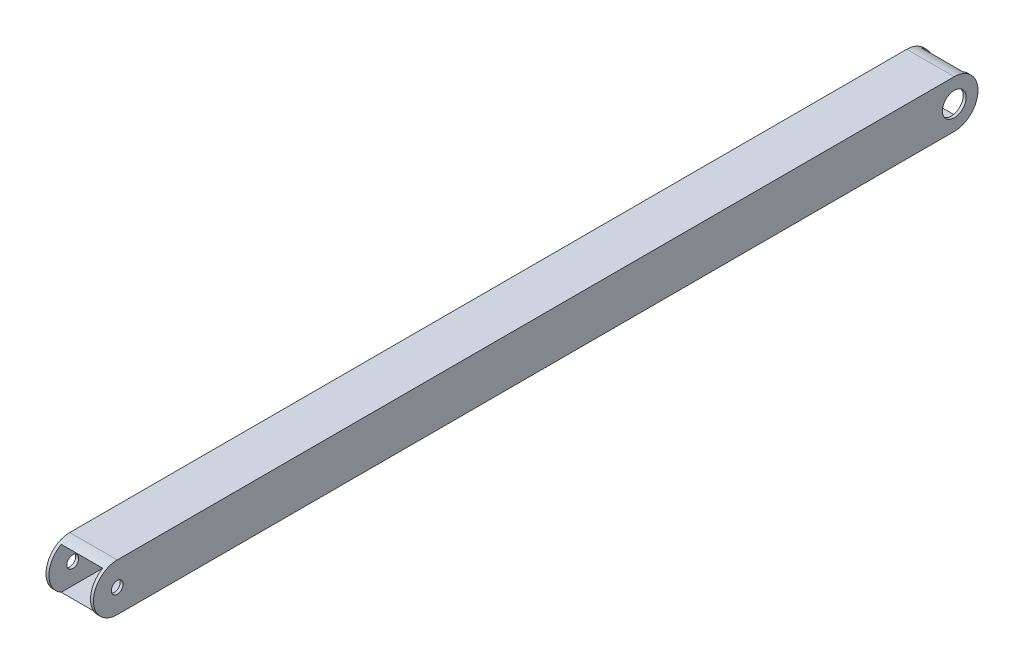
ISO-10303-21;
HEADER;
FILE_DESCRIPTION(('STEP AP214'),'2;1');
FILE_NAME('part.step','',(''),(''),'','','');
FILE_SCHEMA(('AUTOMOTIVE_DESIGN { 1 0 10303 214 1 1 1 1 }'));
ENDSEC;
DATA;
#1=APPLICATION_CONTEXT('core data for automotive mechanical design processes');
#2=APPLICATION_PROTOCOL_DEFINITION('international standard','automotive_design',2000,#1);
#3=PRODUCT_CONTEXT('',#1,'mechanical');
#4=PRODUCT('Part','Part','',(#3));
#5=PRODUCT_RELATED_PRODUCT_CATEGORY('part','',(#4));
#6=PRODUCT_DEFINITION_FORMATION('','',#4);
#7=PRODUCT_DEFINITION_CONTEXT('part definition',#1,'design');
#8=PRODUCT_DEFINITION('design','',#6,#7);
#9=PRODUCT_DEFINITION_SHAPE('','',#8);
#10=(LENGTH_UNIT() NAMED_UNIT(*) SI_UNIT(.MILLI.,.METRE.));
#11=(NAMED_UNIT(*) PLANE_ANGLE_UNIT() SI_UNIT($,.RADIAN.));
#12=(NAMED_UNIT(*) SI_UNIT($,.STERADIAN.) SOLID_ANGLE_UNIT());
#13=UNCERTAINTY_MEASURE_WITH_UNIT(LENGTH_MEASURE(1.E-05),#10,'distance_accuracy_value','');
#14=(GEOMETRIC_REPRESENTATION_CONTEXT(3) GLOBAL_UNCERTAINTY_ASSIGNED_CONTEXT((#13)) GLOBAL_UNIT_ASSIGNED_CONTEXT((#10,
#11,#12)) REPRESENTATION_CONTEXT('',''));
#15=CARTESIAN_POINT('',(0.,0.,0.));
#16=DIRECTION('',(0.,0.,1.));
#17=DIRECTION('',(1.,0.,0.));
#18=AXIS2_PLACEMENT_3D('',#15,#16,#17);
#19=CARTESIAN_POINT('',(12.7,12.7,473.2274));
#20=DIRECTION('',(-1.,0.,0.));
#21=DIRECTION('',(0.,-1.,0.));
#22=AXIS2_PLACEMENT_3D('',#19,#20,#21);
#23=PLANE('',#22);
#24=CARTESIAN_POINT('',(12.7,0.,460.5274));
#25=DIRECTION('',(1.,0.,0.));
#26=DIRECTION('',(0.,1.,0.));
#27=AXIS2_PLACEMENT_3D('',#24,#25,#26);
#28=CIRCLE('',#27,3.17499999999997);
#29=CARTESIAN_POINT('',(12.7,3.17499999999997,460.5274));
#30=VERTEX_POINT('',#29);
#31=EDGE_CURVE('E233',#30,#30,#28,.T.);
#32=ORIENTED_EDGE('',*,*,#31,.F.);
#33=EDGE_LOOP('',(#32));
#34=FACE_BOUND('',#33,.T.);
#35=CARTESIAN_POINT('',(12.7,0.,12.7));
#36=DIRECTION('',(1.,0.,0.));
#37=DIRECTION('',(0.,1.,0.));
#38=AXIS2_PLACEMENT_3D('',#35,#36,#37);
#39=CIRCLE('',#38,6.35);
#40=CARTESIAN_POINT('',(12.7,6.35,12.7));
#41=VERTEX_POINT('',#40);
#42=EDGE_CURVE('E187',#41,#41,#39,.T.);
#43=ORIENTED_EDGE('',*,*,#42,.F.);
#44=EDGE_LOOP('',(#43));
#45=FACE_BOUND('',#44,.T.);
#46=DIRECTION('',(0.,0.,-1.));
#47=VECTOR('',#46,1.);
#48=CARTESIAN_POINT('',(12.7,-12.7,473.2274));
#49=LINE('',#48,#47);
#50=CARTESIAN_POINT('',(12.7,-12.7,460.5274));
#51=VERTEX_POINT('',#50);
#52=CARTESIAN_POINT('',(12.7,-12.7,12.7));
#53=VERTEX_POINT('',#52);
#54=EDGE_CURVE('E157',#51,#53,#49,.T.);
#55=ORIENTED_EDGE('',*,*,#54,.T.);
#56=CARTESIAN_POINT('',(12.7,0.,12.7));
#57=DIRECTION('',(1.,0.,0.));
#58=DIRECTION('',(0.,1.,0.));
#59=AXIS2_PLACEMENT_3D('',#56,#57,#58);
#60=CIRCLE('',#59,12.7);
#61=CARTESIAN_POINT('',(12.7,12.7,12.7));
#62=VERTEX_POINT('',#61);
#63=EDGE_CURVE('E143',#62,#53,#60,.F.);
#64=ORIENTED_EDGE('',*,*,#63,.F.);
#65=DIRECTION('',(0.,0.,-1.));
#66=VECTOR('',#65,1.);
#67=CARTESIAN_POINT('',(12.7,12.7,473.2274));
#68=LINE('',#67,#66);
#69=CARTESIAN_POINT('',(12.7,12.7,460.5274));
#70=VERTEX_POINT('',#69);
#71=EDGE_CURVE('E159',#70,#62,#68,.T.);
#72=ORIENTED_EDGE('',*,*,#71,.F.);
#73=CARTESIAN_POINT('',(12.7,0.,460.5274));
#74=DIRECTION('',(1.,0.,0.));
#75=DIRECTION('',(0.,1.,0.));
#76=AXIS2_PLACEMENT_3D('',#73,#74,#75);
#77=CIRCLE('',#76,12.7);
#78=EDGE_CURVE('E191',#70,#51,#77,.T.);
#79=ORIENTED_EDGE('',*,*,#78,.T.);
#80=EDGE_LOOP('',(#55,#64,#72,#79));
#81=FACE_BOUND('',#80,.T.);
#82=ADVANCED_FACE('F72',(#34,#45,#81),#23,.F.);
#83=CARTESIAN_POINT('',(-12.7,12.7,473.2274));
#84=DIRECTION('',(1.,0.,0.));
#85=DIRECTION('',(0.,1.,0.));
#86=AXIS2_PLACEMENT_3D('',#83,#84,#85);
#87=PLANE('',#86);
#88=CARTESIAN_POINT('',(-12.7,0.,460.5274));
#89=DIRECTION('',(1.,0.,0.));
#90=DIRECTION('',(0.,1.,0.));
#91=AXIS2_PLACEMENT_3D('',#88,#89,#90);
#92=CIRCLE('',#91,3.17499999999997);
#93=CARTESIAN_POINT('',(-12.7,3.17499999999996,460.5274));
#94=VERTEX_POINT('',#93);
#95=EDGE_CURVE('E174',#94,#94,#92,.T.);
#96=ORIENTED_EDGE('',*,*,#95,.T.);
#97=EDGE_LOOP('',(#96));
#98=FACE_BOUND('',#97,.T.);
#99=CARTESIAN_POINT('',(-12.7,0.,12.7));
#100=DIRECTION('',(1.,0.,0.));
#101=DIRECTION('',(0.,1.,0.));
#102=AXIS2_PLACEMENT_3D('',#99,#100,#101);
#103=CIRCLE('',#102,6.35);
#104=CARTESIAN_POINT('',(-12.7,6.35,12.7));
#105=VERTEX_POINT('',#104);
#106=EDGE_CURVE('E227',#105,#105,#103,.T.);
#107=ORIENTED_EDGE('',*,*,#106,.T.);
#108=EDGE_LOOP('',(#107));
#109=FACE_BOUND('',#108,.T.);
#110=CARTESIAN_POINT('',(-12.7,0.,12.7));
#111=DIRECTION('',(1.,0.,0.));
#112=DIRECTION('',(0.,1.,0.));
#113=AXIS2_PLACEMENT_3D('',#110,#111,#112);
#114=CIRCLE('',#113,12.7);
#115=CARTESIAN_POINT('',(-12.7,12.7,12.7));
#116=VERTEX_POINT('',#115);
#117=CARTESIAN_POINT('',(-12.7,-12.7,12.7));
#118=VERTEX_POINT('',#117);
#119=EDGE_CURVE('E86',#116,#118,#114,.F.);
#120=ORIENTED_EDGE('',*,*,#119,.T.);
#121=DIRECTION('',(0.,0.,-1.));
#122=VECTOR('',#121,1.);
#123=CARTESIAN_POINT('',(-12.7,-12.7,473.2274));
#124=LINE('',#123,#122);
#125=CARTESIAN_POINT('',(-12.7,-12.7,460.5274));
#126=VERTEX_POINT('',#125);
#127=EDGE_CURVE('E139',#126,#118,#124,.T.);
#128=ORIENTED_EDGE('',*,*,#127,.F.);
#129=CARTESIAN_POINT('',(-12.7,0.,460.5274));
#130=DIRECTION('',(1.,0.,0.));
#131=DIRECTION('',(0.,1.,0.));
#132=AXIS2_PLACEMENT_3D('',#129,#130,#131);
#133=CIRCLE('',#132,12.7);
#134=CARTESIAN_POINT('',(-12.7,12.7,460.5274));
#135=VERTEX_POINT('',#134);
#136=EDGE_CURVE('E192',#135,#126,#133,.T.);
#137=ORIENTED_EDGE('',*,*,#136,.F.);
#138=DIRECTION('',(0.,0.,-1.));
#139=VECTOR('',#138,1.);
#140=CARTESIAN_POINT('',(-12.7,12.7,473.2274));
#141=LINE('',#140,#139);
#142=EDGE_CURVE('E141',#135,#116,#141,.T.);
#143=ORIENTED_EDGE('',*,*,#142,.T.);
#144=EDGE_LOOP('',(#120,#128,#137,#143));
#145=FACE_BOUND('',#144,.T.);
#146=ADVANCED_FACE('F136',(#98,#109,#145),#87,.F.);
#147=CARTESIAN_POINT('',(-11.1125,11.1125,473.2274));
#148=DIRECTION('',(1.,0.,0.));
#149=DIRECTION('',(0.,1.,0.));
#150=AXIS2_PLACEMENT_3D('',#147,#148,#149);
#151=PLANE('',#150);
#152=CARTESIAN_POINT('',(-11.1125,0.,460.5274));
#153=DIRECTION('',(1.,0.,0.));
#154=DIRECTION('',(0.,1.,0.));
#155=AXIS2_PLACEMENT_3D('',#152,#153,#154);
#156=CIRCLE('',#155,3.17499999999997);
#157=CARTESIAN_POINT('',(-11.1125,3.17499999999997,460.5274));
#158=VERTEX_POINT('',#157);
#159=EDGE_CURVE('E177',#158,#158,#156,.T.);
#160=ORIENTED_EDGE('',*,*,#159,.F.);
#161=EDGE_LOOP('',(#160));
#162=FACE_BOUND('',#161,.T.);
#163=CARTESIAN_POINT('',(-11.1125,0.,12.7));
#164=DIRECTION('',(1.,0.,0.));
#165=DIRECTION('',(0.,1.,0.));
#166=AXIS2_PLACEMENT_3D('',#163,#164,#165);
#167=CIRCLE('',#166,6.35);
#168=CARTESIAN_POINT('',(-11.1125,6.35,12.7));
#169=VERTEX_POINT('',#168);
#170=EDGE_CURVE('E173',#169,#169,#167,.T.);
#171=ORIENTED_EDGE('',*,*,#170,.F.);
#172=EDGE_LOOP('',(#171));
#173=FACE_BOUND('',#172,.T.);
#174=DIRECTION('',(0.,0.,-1.));
#175=VECTOR('',#174,1.);
#176=CARTESIAN_POINT('',(-11.1125,-11.1125,473.2274));
#177=LINE('',#176,#175);
#178=CARTESIAN_POINT('',(-11.1125,-11.1125,466.675761062104));
#179=VERTEX_POINT('',#178);
#180=CARTESIAN_POINT('',(-11.1125,-11.1125,6.55163893789571));
#181=VERTEX_POINT('',#180);
#182=EDGE_CURVE('E161',#179,#181,#177,.T.);
#183=ORIENTED_EDGE('',*,*,#182,.T.);
#184=CARTESIAN_POINT('',(-11.1125,0.,12.7));
#185=DIRECTION('',(1.,0.,0.));
#186=DIRECTION('',(0.,1.,0.));
#187=AXIS2_PLACEMENT_3D('',#184,#185,#186);
#188=CIRCLE('',#187,12.7);
#189=CARTESIAN_POINT('',(-11.1125,11.1125,6.55163893789574));
#190=VERTEX_POINT('',#189);
#191=EDGE_CURVE('E216',#190,#181,#188,.F.);
#192=ORIENTED_EDGE('',*,*,#191,.F.);
#193=DIRECTION('',(0.,0.,-1.));
#194=VECTOR('',#193,1.);
#195=CARTESIAN_POINT('',(-11.1125,11.1125,473.2274));
#196=LINE('',#195,#194);
#197=CARTESIAN_POINT('',(-11.1125,11.1125,466.675761062104));
#198=VERTEX_POINT('',#197);
#199=EDGE_CURVE('E202',#198,#190,#196,.T.);
#200=ORIENTED_EDGE('',*,*,#199,.F.);
#201=CARTESIAN_POINT('',(-11.1125,0.,460.5274));
#202=DIRECTION('',(1.,0.,0.));
#203=DIRECTION('',(0.,1.,0.));
#204=AXIS2_PLACEMENT_3D('',#201,#202,#203);
#205=CIRCLE('',#204,12.7);
#206=EDGE_CURVE('E94',#198,#179,#205,.T.);
#207=ORIENTED_EDGE('',*,*,#206,.T.);
#208=EDGE_LOOP('',(#183,#192,#200,#207));
#209=FACE_BOUND('',#208,.T.);
#210=ADVANCED_FACE('F214',(#162,#173,#209),#151,.T.);
#211=CARTESIAN_POINT('',(11.1125,11.1125,473.2274));
#212=DIRECTION('',(-1.,0.,0.));
#213=DIRECTION('',(0.,-1.,0.));
#214=AXIS2_PLACEMENT_3D('',#211,#212,#213);
#215=PLANE('',#214);
#216=CARTESIAN_POINT('',(11.1125,0.,460.5274));
#217=DIRECTION('',(-1.,0.,0.));
#218=DIRECTION('',(0.,-1.,0.));
#219=AXIS2_PLACEMENT_3D('',#216,#217,#218);
#220=CIRCLE('',#219,3.17499999999997);
#221=CARTESIAN_POINT('',(11.1125,-3.17499999999997,460.5274));
#222=VERTEX_POINT('',#221);
#223=EDGE_CURVE('E175',#222,#222,#220,.T.);
#224=ORIENTED_EDGE('',*,*,#223,.F.);
#225=EDGE_LOOP('',(#224));
#226=FACE_BOUND('',#225,.T.);
#227=CARTESIAN_POINT('',(11.1125,0.,12.7));
#228=DIRECTION('',(-1.,0.,0.));
#229=DIRECTION('',(0.,-1.,0.));
#230=AXIS2_PLACEMENT_3D('',#227,#228,#229);
#231=CIRCLE('',#230,6.35);
#232=CARTESIAN_POINT('',(11.1125,-6.35,12.7));
#233=VERTEX_POINT('',#232);
#234=EDGE_CURVE('E171',#233,#233,#231,.T.);
#235=ORIENTED_EDGE('',*,*,#234,.F.);
#236=EDGE_LOOP('',(#235));
#237=FACE_BOUND('',#236,.T.);
#238=CARTESIAN_POINT('',(11.1125,0.,12.7));
#239=DIRECTION('',(-1.,0.,0.));
#240=DIRECTION('',(0.,-1.,0.));
#241=AXIS2_PLACEMENT_3D('',#238,#239,#240);
#242=CIRCLE('',#241,12.7);
#243=CARTESIAN_POINT('',(11.1125,-11.1125,6.55163893789571));
#244=VERTEX_POINT('',#243);
#245=CARTESIAN_POINT('',(11.1125,11.1125,6.55163893789574));
#246=VERTEX_POINT('',#245);
#247=EDGE_CURVE('E222',#244,#246,#242,.F.);
#248=ORIENTED_EDGE('',*,*,#247,.F.);
#249=DIRECTION('',(0.,0.,-1.));
#250=VECTOR('',#249,1.);
#251=CARTESIAN_POINT('',(11.1125,-11.1125,473.2274));
#252=LINE('',#251,#250);
#253=CARTESIAN_POINT('',(11.1125,-11.1125,466.675761062104));
#254=VERTEX_POINT('',#253);
#255=EDGE_CURVE('E208',#254,#244,#252,.T.);
#256=ORIENTED_EDGE('',*,*,#255,.F.);
#257=CARTESIAN_POINT('',(11.1125,0.,460.5274));
#258=DIRECTION('',(-1.,0.,0.));
#259=DIRECTION('',(0.,-1.,0.));
#260=AXIS2_PLACEMENT_3D('',#257,#258,#259);
#261=CIRCLE('',#260,12.7);
#262=CARTESIAN_POINT('',(11.1125,11.1125,466.675761062104));
#263=VERTEX_POINT('',#262);
#264=EDGE_CURVE('E198',#254,#263,#261,.T.);
#265=ORIENTED_EDGE('',*,*,#264,.T.);
#266=DIRECTION('',(0.,0.,-1.));
#267=VECTOR('',#266,1.);
#268=CARTESIAN_POINT('',(11.1125,11.1125,473.2274));
#269=LINE('',#268,#267);
#270=EDGE_CURVE('E205',#263,#246,#269,.T.);
#271=ORIENTED_EDGE('',*,*,#270,.T.);
#272=EDGE_LOOP('',(#248,#256,#265,#271));
#273=FACE_BOUND('',#272,.T.);
#274=ADVANCED_FACE('F283',(#226,#237,#273),#215,.T.);
#275=CARTESIAN_POINT('',(-12.7,-12.7,473.2274));
#276=DIRECTION('',(0.,1.,0.));
#277=DIRECTION('',(0.,0.,1.));
#278=AXIS2_PLACEMENT_3D('',#275,#276,#277);
#279=PLANE('',#278);
#280=DIRECTION('',(1.,0.,0.));
#281=VECTOR('',#280,1.);
#282=CARTESIAN_POINT('',(-12.7,-12.7,12.7));
#283=LINE('',#282,#281);
#284=EDGE_CURVE('E146',#118,#53,#283,.T.);
#285=ORIENTED_EDGE('',*,*,#284,.T.);
#286=ORIENTED_EDGE('',*,*,#54,.F.);
#287=DIRECTION('',(1.,0.,0.));
#288=VECTOR('',#287,1.);
#289=CARTESIAN_POINT('',(-12.7,-12.7,460.5274));
#290=LINE('',#289,#288);
#291=EDGE_CURVE('E156',#126,#51,#290,.T.);
#292=ORIENTED_EDGE('',*,*,#291,.F.);
#293=ORIENTED_EDGE('',*,*,#127,.T.);
#294=EDGE_LOOP('',(#285,#286,#292,#293));
#295=FACE_BOUND('',#294,.T.);
#296=ADVANCED_FACE('F154',(#295),#279,.F.);
#297=CARTESIAN_POINT('',(-11.1125,-11.1125,473.2274));
#298=DIRECTION('',(0.,1.,0.));
#299=DIRECTION('',(0.,0.,1.));
#300=AXIS2_PLACEMENT_3D('',#297,#298,#299);
#301=PLANE('',#300);
#302=DIRECTION('',(1.,0.,0.));
#303=VECTOR('',#302,1.);
#304=CARTESIAN_POINT('',(-12.7,-11.1125,6.55163893789571));
#305=LINE('',#304,#303);
#306=EDGE_CURVE('E12',#181,#244,#305,.T.);
#307=ORIENTED_EDGE('',*,*,#306,.F.);
#308=ORIENTED_EDGE('',*,*,#182,.F.);
#309=DIRECTION('',(1.,0.,0.));
#310=VECTOR('',#309,1.);
#311=CARTESIAN_POINT('',(-12.7,-11.1125,466.675761062104));
#312=LINE('',#311,#310);
#313=EDGE_CURVE('E79',#179,#254,#312,.T.);
#314=ORIENTED_EDGE('',*,*,#313,.T.);
#315=ORIENTED_EDGE('',*,*,#255,.T.);
#316=EDGE_LOOP('',(#307,#308,#314,#315));
#317=FACE_BOUND('',#316,.T.);
#318=ADVANCED_FACE('F219',(#317),#301,.T.);
#319=CARTESIAN_POINT('',(-11.1125,11.1125,473.2274));
#320=DIRECTION('',(0.,-1.,0.));
#321=DIRECTION('',(0.,0.,-1.));
#322=AXIS2_PLACEMENT_3D('',#319,#320,#321);
#323=PLANE('',#322);
#324=DIRECTION('',(1.,0.,0.));
#325=VECTOR('',#324,1.);
#326=CARTESIAN_POINT('',(-12.7,11.1125,6.55163893789574));
#327=LINE('',#326,#325);
#328=EDGE_CURVE('E224',#246,#190,#327,.F.);
#329=ORIENTED_EDGE('',*,*,#328,.F.);
#330=ORIENTED_EDGE('',*,*,#270,.F.);
#331=DIRECTION('',(1.,0.,0.));
#332=VECTOR('',#331,1.);
#333=CARTESIAN_POINT('',(-12.7,11.1125,466.675761062104));
#334=LINE('',#333,#332);
#335=EDGE_CURVE('E167',#263,#198,#334,.F.);
#336=ORIENTED_EDGE('',*,*,#335,.T.);
#337=ORIENTED_EDGE('',*,*,#199,.T.);
#338=EDGE_LOOP('',(#329,#330,#336,#337));
#339=FACE_BOUND('',#338,.T.);
#340=ADVANCED_FACE('F273',(#339),#323,.T.);
#341=CARTESIAN_POINT('',(-12.7,12.7,473.2274));
#342=DIRECTION('',(0.,-1.,0.));
#343=DIRECTION('',(0.,0.,-1.));
#344=AXIS2_PLACEMENT_3D('',#341,#342,#343);
#345=PLANE('',#344);
#346=ORIENTED_EDGE('',*,*,#71,.T.);
#347=DIRECTION('',(1.,0.,0.));
#348=VECTOR('',#347,1.);
#349=CARTESIAN_POINT('',(-12.7,12.7,12.7));
#350=LINE('',#349,#348);
#351=EDGE_CURVE('E142',#116,#62,#350,.T.);
#352=ORIENTED_EDGE('',*,*,#351,.F.);
#353=ORIENTED_EDGE('',*,*,#142,.F.);
#354=DIRECTION('',(1.,0.,0.));
#355=VECTOR('',#354,1.);
#356=CARTESIAN_POINT('',(-12.7,12.7,460.5274));
#357=LINE('',#356,#355);
#358=EDGE_CURVE('E194',#135,#70,#357,.T.);
#359=ORIENTED_EDGE('',*,*,#358,.T.);
#360=EDGE_LOOP('',(#346,#352,#353,#359));
#361=FACE_BOUND('',#360,.T.);
#362=ADVANCED_FACE('F269',(#361),#345,.F.);
#363=CARTESIAN_POINT('',(-12.7,0.,460.5274));
#364=DIRECTION('',(1.,0.,0.));
#365=DIRECTION('',(0.,1.,0.));
#366=AXIS2_PLACEMENT_3D('',#363,#364,#365);
#367=CYLINDRICAL_SURFACE('',#366,12.7);
#368=ORIENTED_EDGE('',*,*,#291,.T.);
#369=ORIENTED_EDGE('',*,*,#78,.F.);
#370=ORIENTED_EDGE('',*,*,#358,.F.);
#371=ORIENTED_EDGE('',*,*,#136,.T.);
#372=EDGE_LOOP('',(#368,#369,#370,#371));
#373=FACE_BOUND('',#372,.T.);
#374=ORIENTED_EDGE('',*,*,#335,.F.);
#375=ORIENTED_EDGE('',*,*,#264,.F.);
#376=ORIENTED_EDGE('',*,*,#313,.F.);
#377=ORIENTED_EDGE('',*,*,#206,.F.);
#378=EDGE_LOOP('',(#374,#375,#376,#377));
#379=FACE_BOUND('',#378,.T.);
#380=ADVANCED_FACE('F253',(#373,#379),#367,.T.);
#381=CARTESIAN_POINT('',(-12.7,0.,12.7));
#382=DIRECTION('',(1.,0.,0.));
#383=DIRECTION('',(0.,1.,0.));
#384=AXIS2_PLACEMENT_3D('',#381,#382,#383);
#385=CYLINDRICAL_SURFACE('',#384,6.35);
#386=ORIENTED_EDGE('',*,*,#234,.T.);
#387=EDGE_LOOP('',(#386));
#388=FACE_BOUND('',#387,.T.);
#389=ORIENTED_EDGE('',*,*,#42,.T.);
#390=EDGE_LOOP('',(#389));
#391=FACE_BOUND('',#390,.T.);
#392=ADVANCED_FACE('F244',(#388,#391),#385,.F.);
#393=CARTESIAN_POINT('',(-12.7,0.,460.5274));
#394=DIRECTION('',(1.,0.,0.));
#395=DIRECTION('',(0.,1.,0.));
#396=AXIS2_PLACEMENT_3D('',#393,#394,#395);
#397=CYLINDRICAL_SURFACE('',#396,3.17499999999997);
#398=ORIENTED_EDGE('',*,*,#223,.T.);
#399=EDGE_LOOP('',(#398));
#400=FACE_BOUND('',#399,.T.);
#401=ORIENTED_EDGE('',*,*,#31,.T.);
#402=EDGE_LOOP('',(#401));
#403=FACE_BOUND('',#402,.T.);
#404=ADVANCED_FACE('F242',(#400,#403),#397,.F.);
#405=ORIENTED_EDGE('',*,*,#170,.T.);
#406=EDGE_LOOP('',(#405));
#407=FACE_BOUND('',#406,.T.);
#408=ORIENTED_EDGE('',*,*,#106,.F.);
#409=EDGE_LOOP('',(#408));
#410=FACE_BOUND('',#409,.T.);
#411=ADVANCED_FACE('F239',(#407,#410),#385,.F.);
#412=ORIENTED_EDGE('',*,*,#159,.T.);
#413=EDGE_LOOP('',(#412));
#414=FACE_BOUND('',#413,.T.);
#415=ORIENTED_EDGE('',*,*,#95,.F.);
#416=EDGE_LOOP('',(#415));
#417=FACE_BOUND('',#416,.T.);
#418=ADVANCED_FACE('F241',(#414,#417),#397,.F.);
#419=CARTESIAN_POINT('',(-12.7,0.,12.7));
#420=DIRECTION('',(1.,0.,0.));
#421=DIRECTION('',(0.,1.,0.));
#422=AXIS2_PLACEMENT_3D('',#419,#420,#421);
#423=CYLINDRICAL_SURFACE('',#422,12.7);
#424=ORIENTED_EDGE('',*,*,#191,.T.);
#425=ORIENTED_EDGE('',*,*,#306,.T.);
#426=ORIENTED_EDGE('',*,*,#247,.T.);
#427=ORIENTED_EDGE('',*,*,#328,.T.);
#428=EDGE_LOOP('',(#424,#425,#426,#427));
#429=FACE_BOUND('',#428,.T.);
#430=ORIENTED_EDGE('',*,*,#284,.F.);
#431=ORIENTED_EDGE('',*,*,#119,.F.);
#432=ORIENTED_EDGE('',*,*,#351,.T.);
#433=ORIENTED_EDGE('',*,*,#63,.T.);
#434=EDGE_LOOP('',(#430,#431,#432,#433));
#435=FACE_BOUND('',#434,.T.);
#436=ADVANCED_FACE('F147',(#429,#435),#423,.T.);
#437=CLOSED_SHELL('',(#82,#146,#210,#274,#296,#318,#340,#362,#380,#392,#404,#411,#418,#436));
#438=MANIFOLD_SOLID_BREP('B2',#437);
#439=ADVANCED_BREP_SHAPE_REPRESENTATION('',(#18,#438),#14);
#440=SHAPE_DEFINITION_REPRESENTATION(#9,#439);
ENDSEC;
END-ISO-10303-21;
